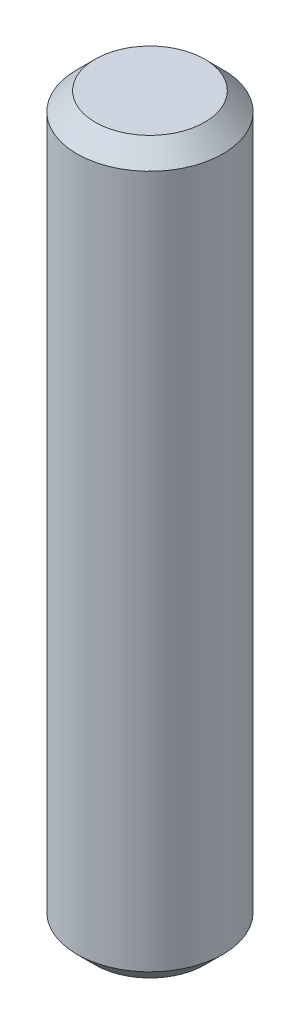
ISO-10303-21;
HEADER;
FILE_DESCRIPTION(('STEP AP214'),'2;1');
FILE_NAME('part.step','',(''),(''),'','','');
FILE_SCHEMA(('AUTOMOTIVE_DESIGN { 1 0 10303 214 1 1 1 1 }'));
ENDSEC;
DATA;
#1=APPLICATION_CONTEXT('core data for automotive mechanical design processes');
#2=APPLICATION_PROTOCOL_DEFINITION('international standard','automotive_design',2000,#1);
#3=PRODUCT_CONTEXT('',#1,'mechanical');
#4=PRODUCT('Part','Part','',(#3));
#5=PRODUCT_RELATED_PRODUCT_CATEGORY('part','',(#4));
#6=PRODUCT_DEFINITION_FORMATION('','',#4);
#7=PRODUCT_DEFINITION_CONTEXT('part definition',#1,'design');
#8=PRODUCT_DEFINITION('design','',#6,#7);
#9=PRODUCT_DEFINITION_SHAPE('','',#8);
#10=(LENGTH_UNIT() NAMED_UNIT(*) SI_UNIT(.MILLI.,.METRE.));
#11=(NAMED_UNIT(*) PLANE_ANGLE_UNIT() SI_UNIT($,.RADIAN.));
#12=(NAMED_UNIT(*) SI_UNIT($,.STERADIAN.) SOLID_ANGLE_UNIT());
#13=UNCERTAINTY_MEASURE_WITH_UNIT(LENGTH_MEASURE(1.E-05),#10,'distance_accuracy_value','');
#14=(GEOMETRIC_REPRESENTATION_CONTEXT(3) GLOBAL_UNCERTAINTY_ASSIGNED_CONTEXT((#13)) GLOBAL_UNIT_ASSIGNED_CONTEXT((#10,
#11,#12)) REPRESENTATION_CONTEXT('',''));
#15=CARTESIAN_POINT('',(0.,0.,0.));
#16=DIRECTION('',(0.,0.,1.));
#17=DIRECTION('',(1.,0.,0.));
#18=AXIS2_PLACEMENT_3D('',#15,#16,#17);
#19=CARTESIAN_POINT('',(0.,2.,0.));
#20=DIRECTION('',(0.,-1.,0.));
#21=DIRECTION('',(0.,0.,-1.));
#22=AXIS2_PLACEMENT_3D('',#19,#20,#21);
#23=CYLINDRICAL_SURFACE('',#22,0.199999999999999);
#24=CARTESIAN_POINT('',(0.,0.0500000000000001,0.));
#25=DIRECTION('',(0.,1.,0.));
#26=DIRECTION('',(0.,0.,1.));
#27=AXIS2_PLACEMENT_3D('',#24,#25,#26);
#28=CIRCLE('',#27,0.199999999999999);
#29=CARTESIAN_POINT('',(0.,0.0500000000000001,0.199999999999999));
#30=VERTEX_POINT('',#29);
#31=EDGE_CURVE('E42',#30,#30,#28,.T.);
#32=ORIENTED_EDGE('',*,*,#31,.T.);
#33=EDGE_LOOP('',(#32));
#34=FACE_BOUND('',#33,.T.);
#35=CARTESIAN_POINT('',(0.,1.95,0.));
#36=DIRECTION('',(0.,1.,0.));
#37=DIRECTION('',(0.,0.,1.));
#38=AXIS2_PLACEMENT_3D('',#35,#36,#37);
#39=CIRCLE('',#38,0.199999999999999);
#40=CARTESIAN_POINT('',(0.,1.95,0.199999999999999));
#41=VERTEX_POINT('',#40);
#42=EDGE_CURVE('E46',#41,#41,#39,.F.);
#43=ORIENTED_EDGE('',*,*,#42,.T.);
#44=EDGE_LOOP('',(#43));
#45=FACE_BOUND('',#44,.T.);
#46=ADVANCED_FACE('F31',(#34,#45),#23,.T.);
#47=CARTESIAN_POINT('',(0.,2.,0.));
#48=DIRECTION('',(0.,1.,0.));
#49=DIRECTION('',(0.,0.,1.));
#50=AXIS2_PLACEMENT_3D('',#47,#48,#49);
#51=PLANE('',#50);
#52=CARTESIAN_POINT('',(0.,2.,0.));
#53=DIRECTION('',(0.,1.,0.));
#54=DIRECTION('',(0.,0.,1.));
#55=AXIS2_PLACEMENT_3D('',#52,#53,#54);
#56=CIRCLE('',#55,0.149999999999998);
#57=CARTESIAN_POINT('',(0.,2.,0.149999999999998));
#58=VERTEX_POINT('',#57);
#59=EDGE_CURVE('E10',#58,#58,#56,.T.);
#60=ORIENTED_EDGE('',*,*,#59,.T.);
#61=EDGE_LOOP('',(#60));
#62=FACE_BOUND('',#61,.T.);
#63=ADVANCED_FACE('F62',(#62),#51,.T.);
#64=CARTESIAN_POINT('',(0.,0.,0.));
#65=DIRECTION('',(0.,1.,0.));
#66=DIRECTION('',(0.,0.,1.));
#67=AXIS2_PLACEMENT_3D('',#64,#65,#66);
#68=PLANE('',#67);
#69=CARTESIAN_POINT('',(0.,0.,0.));
#70=DIRECTION('',(0.,1.,0.));
#71=DIRECTION('',(0.,0.,1.));
#72=AXIS2_PLACEMENT_3D('',#69,#70,#71);
#73=CIRCLE('',#72,0.149999999999998);
#74=CARTESIAN_POINT('',(0.,0.,0.149999999999998));
#75=VERTEX_POINT('',#74);
#76=EDGE_CURVE('E38',#75,#75,#73,.F.);
#77=ORIENTED_EDGE('',*,*,#76,.T.);
#78=EDGE_LOOP('',(#77));
#79=FACE_BOUND('',#78,.T.);
#80=ADVANCED_FACE('F59',(#79),#68,.F.);
#81=CARTESIAN_POINT('',(0.,0.0500000000000001,0.));
#82=DIRECTION('',(0.,1.,0.));
#83=DIRECTION('',(0.,0.,1.));
#84=AXIS2_PLACEMENT_3D('',#81,#82,#83);
#85=CONICAL_SURFACE('',#84,0.199999999999999,0.785398163397451);
#86=ORIENTED_EDGE('',*,*,#76,.F.);
#87=EDGE_LOOP('',(#86));
#88=FACE_BOUND('',#87,.T.);
#89=ORIENTED_EDGE('',*,*,#31,.F.);
#90=EDGE_LOOP('',(#89));
#91=FACE_BOUND('',#90,.T.);
#92=ADVANCED_FACE('F55',(#88,#91),#85,.T.);
#93=CARTESIAN_POINT('',(0.,2.,0.));
#94=DIRECTION('',(0.,-1.,0.));
#95=DIRECTION('',(0.,0.,-1.));
#96=AXIS2_PLACEMENT_3D('',#93,#94,#95);
#97=CONICAL_SURFACE('',#96,0.149999999999998,0.785398163397449);
#98=ORIENTED_EDGE('',*,*,#42,.F.);
#99=EDGE_LOOP('',(#98));
#100=FACE_BOUND('',#99,.T.);
#101=ORIENTED_EDGE('',*,*,#59,.F.);
#102=EDGE_LOOP('',(#101));
#103=FACE_BOUND('',#102,.T.);
#104=ADVANCED_FACE('F33',(#100,#103),#97,.T.);
#105=CLOSED_SHELL('',(#46,#63,#80,#92,#104));
#106=MANIFOLD_SOLID_BREP('B2',#105);
#107=ADVANCED_BREP_SHAPE_REPRESENTATION('',(#18,#106),#14);
#108=SHAPE_DEFINITION_REPRESENTATION(#9,#107);
ENDSEC;
END-ISO-10303-21;
